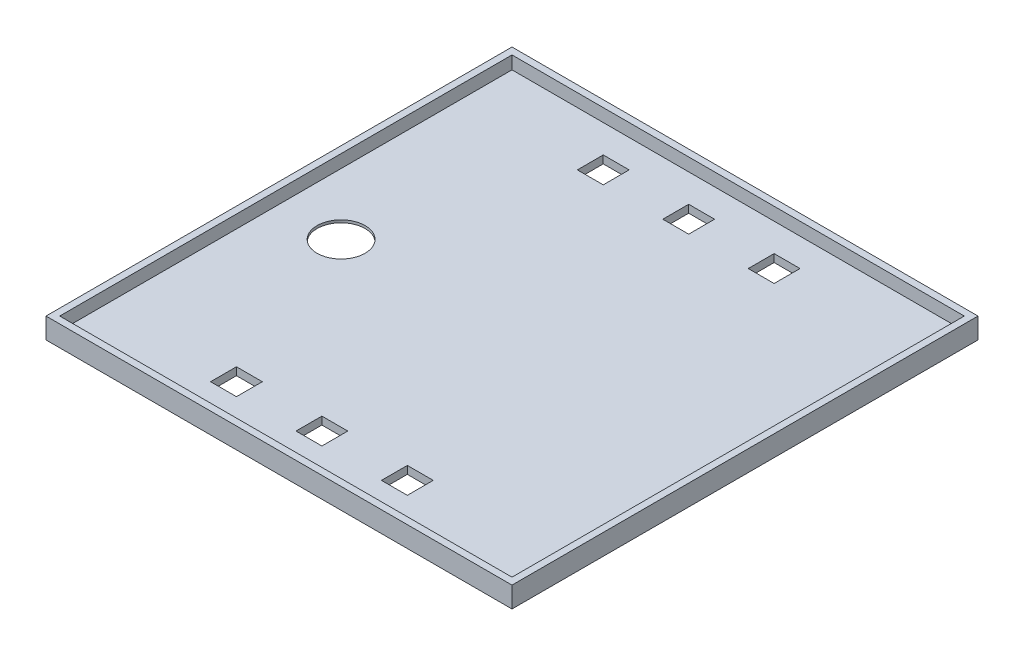
ISO-10303-21;
HEADER;
FILE_DESCRIPTION(('STEP AP214'),'2;1');
FILE_NAME('part.step','',(''),(''),'','','');
FILE_SCHEMA(('AUTOMOTIVE_DESIGN { 1 0 10303 214 1 1 1 1 }'));
ENDSEC;
DATA;
#1=APPLICATION_CONTEXT('core data for automotive mechanical design processes');
#2=APPLICATION_PROTOCOL_DEFINITION('international standard','automotive_design',2000,#1);
#3=PRODUCT_CONTEXT('',#1,'mechanical');
#4=PRODUCT('Part','Part','',(#3));
#5=PRODUCT_RELATED_PRODUCT_CATEGORY('part','',(#4));
#6=PRODUCT_DEFINITION_FORMATION('','',#4);
#7=PRODUCT_DEFINITION_CONTEXT('part definition',#1,'design');
#8=PRODUCT_DEFINITION('design','',#6,#7);
#9=PRODUCT_DEFINITION_SHAPE('','',#8);
#10=(LENGTH_UNIT() NAMED_UNIT(*) SI_UNIT(.MILLI.,.METRE.));
#11=(NAMED_UNIT(*) PLANE_ANGLE_UNIT() SI_UNIT($,.RADIAN.));
#12=(NAMED_UNIT(*) SI_UNIT($,.STERADIAN.) SOLID_ANGLE_UNIT());
#13=UNCERTAINTY_MEASURE_WITH_UNIT(LENGTH_MEASURE(1.E-05),#10,'distance_accuracy_value','');
#14=(GEOMETRIC_REPRESENTATION_CONTEXT(3) GLOBAL_UNCERTAINTY_ASSIGNED_CONTEXT((#13)) GLOBAL_UNIT_ASSIGNED_CONTEXT((#10,
#11,#12)) REPRESENTATION_CONTEXT('',''));
#15=CARTESIAN_POINT('',(0.,0.,0.));
#16=DIRECTION('',(0.,0.,1.));
#17=DIRECTION('',(1.,0.,0.));
#18=AXIS2_PLACEMENT_3D('',#15,#16,#17);
#19=CARTESIAN_POINT('',(45.,4.,45.));
#20=DIRECTION('',(-1.,0.,0.));
#21=DIRECTION('',(0.,0.,1.));
#22=AXIS2_PLACEMENT_3D('',#19,#20,#21);
#23=PLANE('',#22);
#24=DIRECTION('',(0.,0.,-1.));
#25=VECTOR('',#24,1.);
#26=CARTESIAN_POINT('',(45.,0.,45.));
#27=LINE('',#26,#25);
#28=CARTESIAN_POINT('',(45.,0.,45.));
#29=VERTEX_POINT('',#28);
#30=CARTESIAN_POINT('',(45.,0.,-45.));
#31=VERTEX_POINT('',#30);
#32=EDGE_CURVE('E406',#29,#31,#27,.T.);
#33=ORIENTED_EDGE('',*,*,#32,.T.);
#34=DIRECTION('',(0.,-1.,0.));
#35=VECTOR('',#34,1.);
#36=CARTESIAN_POINT('',(45.,4.,-45.));
#37=LINE('',#36,#35);
#38=CARTESIAN_POINT('',(45.,4.,-45.));
#39=VERTEX_POINT('',#38);
#40=EDGE_CURVE('E439',#39,#31,#37,.T.);
#41=ORIENTED_EDGE('',*,*,#40,.F.);
#42=DIRECTION('',(0.,0.,-1.));
#43=VECTOR('',#42,1.);
#44=CARTESIAN_POINT('',(45.,4.,45.));
#45=LINE('',#44,#43);
#46=CARTESIAN_POINT('',(45.,4.,45.));
#47=VERTEX_POINT('',#46);
#48=EDGE_CURVE('E413',#47,#39,#45,.T.);
#49=ORIENTED_EDGE('',*,*,#48,.F.);
#50=DIRECTION('',(0.,-1.,0.));
#51=VECTOR('',#50,1.);
#52=CARTESIAN_POINT('',(45.,4.,45.));
#53=LINE('',#52,#51);
#54=EDGE_CURVE('E423',#47,#29,#53,.T.);
#55=ORIENTED_EDGE('',*,*,#54,.T.);
#56=EDGE_LOOP('',(#33,#41,#49,#55));
#57=FACE_BOUND('',#56,.T.);
#58=ADVANCED_FACE('F41',(#57),#23,.F.);
#59=CARTESIAN_POINT('',(-45.,4.,-45.));
#60=DIRECTION('',(0.,0.,1.));
#61=DIRECTION('',(1.,0.,0.));
#62=AXIS2_PLACEMENT_3D('',#59,#60,#61);
#63=PLANE('',#62);
#64=DIRECTION('',(-1.,0.,0.));
#65=VECTOR('',#64,1.);
#66=CARTESIAN_POINT('',(-45.,0.,-45.));
#67=LINE('',#66,#65);
#68=CARTESIAN_POINT('',(-45.,0.,-45.));
#69=VERTEX_POINT('',#68);
#70=EDGE_CURVE('E426',#31,#69,#67,.T.);
#71=ORIENTED_EDGE('',*,*,#70,.T.);
#72=DIRECTION('',(0.,-1.,0.));
#73=VECTOR('',#72,1.);
#74=CARTESIAN_POINT('',(-45.,4.,-45.));
#75=LINE('',#74,#73);
#76=CARTESIAN_POINT('',(-45.,4.,-45.));
#77=VERTEX_POINT('',#76);
#78=EDGE_CURVE('E436',#77,#69,#75,.T.);
#79=ORIENTED_EDGE('',*,*,#78,.F.);
#80=DIRECTION('',(-1.,0.,0.));
#81=VECTOR('',#80,1.);
#82=CARTESIAN_POINT('',(-45.,4.,-45.));
#83=LINE('',#82,#81);
#84=EDGE_CURVE('E416',#39,#77,#83,.T.);
#85=ORIENTED_EDGE('',*,*,#84,.F.);
#86=ORIENTED_EDGE('',*,*,#40,.T.);
#87=EDGE_LOOP('',(#71,#79,#85,#86));
#88=FACE_BOUND('',#87,.T.);
#89=ADVANCED_FACE('F538',(#88),#63,.F.);
#90=CARTESIAN_POINT('',(-45.,4.,45.));
#91=DIRECTION('',(1.,0.,0.));
#92=DIRECTION('',(0.,0.,-1.));
#93=AXIS2_PLACEMENT_3D('',#90,#91,#92);
#94=PLANE('',#93);
#95=DIRECTION('',(0.,0.,1.));
#96=VECTOR('',#95,1.);
#97=CARTESIAN_POINT('',(-45.,0.,45.));
#98=LINE('',#97,#96);
#99=CARTESIAN_POINT('',(-45.,0.,45.));
#100=VERTEX_POINT('',#99);
#101=EDGE_CURVE('E428',#69,#100,#98,.T.);
#102=ORIENTED_EDGE('',*,*,#101,.T.);
#103=DIRECTION('',(0.,-1.,0.));
#104=VECTOR('',#103,1.);
#105=CARTESIAN_POINT('',(-45.,4.,45.));
#106=LINE('',#105,#104);
#107=CARTESIAN_POINT('',(-45.,4.,45.));
#108=VERTEX_POINT('',#107);
#109=EDGE_CURVE('E433',#108,#100,#106,.T.);
#110=ORIENTED_EDGE('',*,*,#109,.F.);
#111=DIRECTION('',(0.,0.,1.));
#112=VECTOR('',#111,1.);
#113=CARTESIAN_POINT('',(-45.,4.,45.));
#114=LINE('',#113,#112);
#115=EDGE_CURVE('E419',#77,#108,#114,.T.);
#116=ORIENTED_EDGE('',*,*,#115,.F.);
#117=ORIENTED_EDGE('',*,*,#78,.T.);
#118=EDGE_LOOP('',(#102,#110,#116,#117));
#119=FACE_BOUND('',#118,.T.);
#120=ADVANCED_FACE('F543',(#119),#94,.F.);
#121=CARTESIAN_POINT('',(-45.,4.,45.));
#122=DIRECTION('',(0.,0.,-1.));
#123=DIRECTION('',(-1.,0.,0.));
#124=AXIS2_PLACEMENT_3D('',#121,#122,#123);
#125=PLANE('',#124);
#126=DIRECTION('',(1.,0.,0.));
#127=VECTOR('',#126,1.);
#128=CARTESIAN_POINT('',(-45.,0.,45.));
#129=LINE('',#128,#127);
#130=EDGE_CURVE('E417',#100,#29,#129,.T.);
#131=ORIENTED_EDGE('',*,*,#130,.T.);
#132=ORIENTED_EDGE('',*,*,#54,.F.);
#133=DIRECTION('',(1.,0.,0.));
#134=VECTOR('',#133,1.);
#135=CARTESIAN_POINT('',(-45.,4.,45.));
#136=LINE('',#135,#134);
#137=EDGE_CURVE('E421',#108,#47,#136,.T.);
#138=ORIENTED_EDGE('',*,*,#137,.F.);
#139=ORIENTED_EDGE('',*,*,#109,.T.);
#140=EDGE_LOOP('',(#131,#132,#138,#139));
#141=FACE_BOUND('',#140,.T.);
#142=ADVANCED_FACE('F559',(#141),#125,.F.);
#143=CARTESIAN_POINT('',(0.,4.,0.));
#144=DIRECTION('',(0.,-1.,0.));
#145=DIRECTION('',(0.,0.,-1.));
#146=AXIS2_PLACEMENT_3D('',#143,#144,#145);
#147=PLANE('',#146);
#148=DIRECTION('',(-1.,0.,0.));
#149=VECTOR('',#148,1.);
#150=CARTESIAN_POINT('',(-43.675,4.,-43.675));
#151=LINE('',#150,#149);
#152=CARTESIAN_POINT('',(43.675,4.,-43.675));
#153=VERTEX_POINT('',#152);
#154=CARTESIAN_POINT('',(-43.675,4.,-43.675));
#155=VERTEX_POINT('',#154);
#156=EDGE_CURVE('E396',#153,#155,#151,.T.);
#157=ORIENTED_EDGE('',*,*,#156,.F.);
#158=DIRECTION('',(0.,0.,-1.));
#159=VECTOR('',#158,1.);
#160=CARTESIAN_POINT('',(43.675,4.,43.675));
#161=LINE('',#160,#159);
#162=CARTESIAN_POINT('',(43.675,4.,43.675));
#163=VERTEX_POINT('',#162);
#164=EDGE_CURVE('E374',#163,#153,#161,.T.);
#165=ORIENTED_EDGE('',*,*,#164,.F.);
#166=DIRECTION('',(1.,0.,0.));
#167=VECTOR('',#166,1.);
#168=CARTESIAN_POINT('',(-43.675,4.,43.675));
#169=LINE('',#168,#167);
#170=CARTESIAN_POINT('',(-43.675,4.,43.675));
#171=VERTEX_POINT('',#170);
#172=EDGE_CURVE('E385',#171,#163,#169,.T.);
#173=ORIENTED_EDGE('',*,*,#172,.F.);
#174=DIRECTION('',(0.,0.,1.));
#175=VECTOR('',#174,1.);
#176=CARTESIAN_POINT('',(-43.675,4.,43.675));
#177=LINE('',#176,#175);
#178=EDGE_CURVE('E399',#155,#171,#177,.T.);
#179=ORIENTED_EDGE('',*,*,#178,.F.);
#180=EDGE_LOOP('',(#157,#165,#173,#179));
#181=FACE_BOUND('',#180,.T.);
#182=ORIENTED_EDGE('',*,*,#48,.T.);
#183=ORIENTED_EDGE('',*,*,#84,.T.);
#184=ORIENTED_EDGE('',*,*,#115,.T.);
#185=ORIENTED_EDGE('',*,*,#137,.T.);
#186=EDGE_LOOP('',(#182,#183,#184,#185));
#187=FACE_BOUND('',#186,.T.);
#188=ADVANCED_FACE('F555',(#181,#187),#147,.F.);
#189=CARTESIAN_POINT('',(0.,0.,0.));
#190=DIRECTION('',(0.,-1.,0.));
#191=DIRECTION('',(0.,0.,-1.));
#192=AXIS2_PLACEMENT_3D('',#189,#190,#191);
#193=PLANE('',#192);
#194=CARTESIAN_POINT('',(-31.8184158682217,0.,1.19003743829275));
#195=DIRECTION('',(0.,-1.,0.));
#196=DIRECTION('',(0.,0.,-1.));
#197=AXIS2_PLACEMENT_3D('',#194,#195,#196);
#198=CIRCLE('',#197,6.5);
#199=CARTESIAN_POINT('',(-31.8184158682217,0.,-5.30996256170725));
#200=VERTEX_POINT('',#199);
#201=EDGE_CURVE('E982',#200,#200,#198,.T.);
#202=ORIENTED_EDGE('',*,*,#201,.F.);
#203=EDGE_LOOP('',(#202));
#204=FACE_BOUND('',#203,.T.);
#205=DIRECTION('',(0.,0.,1.));
#206=VECTOR('',#205,1.);
#207=CARTESIAN_POINT('',(0.866184452047224,0.,-38.2574744765441));
#208=LINE('',#207,#206);
#209=CARTESIAN_POINT('',(0.866184452047224,0.,-38.2574744765441));
#210=VERTEX_POINT('',#209);
#211=CARTESIAN_POINT('',(0.866184452047224,0.,-33.2574744765441));
#212=VERTEX_POINT('',#211);
#213=EDGE_CURVE('E56',#210,#212,#208,.T.);
#214=ORIENTED_EDGE('',*,*,#213,.F.);
#215=DIRECTION('',(1.,0.,0.));
#216=VECTOR('',#215,1.);
#217=CARTESIAN_POINT('',(0.866184452047224,0.,-38.2574744765441));
#218=LINE('',#217,#216);
#219=CARTESIAN_POINT('',(-4.13381554795278,0.,-38.2574744765441));
#220=VERTEX_POINT('',#219);
#221=EDGE_CURVE('E289',#220,#210,#218,.T.);
#222=ORIENTED_EDGE('',*,*,#221,.F.);
#223=DIRECTION('',(0.,0.,-1.));
#224=VECTOR('',#223,1.);
#225=CARTESIAN_POINT('',(-4.13381554795278,0.,-38.2574744765441));
#226=LINE('',#225,#224);
#227=CARTESIAN_POINT('',(-4.13381554795278,0.,-33.2574744765441));
#228=VERTEX_POINT('',#227);
#229=EDGE_CURVE('E298',#228,#220,#226,.T.);
#230=ORIENTED_EDGE('',*,*,#229,.F.);
#231=DIRECTION('',(-1.,0.,0.));
#232=VECTOR('',#231,1.);
#233=CARTESIAN_POINT('',(0.866184452047224,0.,-33.2574744765441));
#234=LINE('',#233,#232);
#235=EDGE_CURVE('E301',#212,#228,#234,.T.);
#236=ORIENTED_EDGE('',*,*,#235,.F.);
#237=EDGE_LOOP('',(#214,#222,#230,#236));
#238=FACE_BOUND('',#237,.T.);
#239=DIRECTION('',(0.,0.,1.));
#240=VECTOR('',#239,1.);
#241=CARTESIAN_POINT('',(-15.6344538149361,0.,-38.2574744765441));
#242=LINE('',#241,#240);
#243=CARTESIAN_POINT('',(-15.6344538149361,0.,-38.2574744765441));
#244=VERTEX_POINT('',#243);
#245=CARTESIAN_POINT('',(-15.6344538149361,0.,-33.2574744765441));
#246=VERTEX_POINT('',#245);
#247=EDGE_CURVE('E64',#244,#246,#242,.T.);
#248=ORIENTED_EDGE('',*,*,#247,.F.);
#249=DIRECTION('',(1.,0.,0.));
#250=VECTOR('',#249,1.);
#251=CARTESIAN_POINT('',(-15.6344538149361,0.,-38.2574744765441));
#252=LINE('',#251,#250);
#253=CARTESIAN_POINT('',(-20.6344538149361,0.,-38.2574744765441));
#254=VERTEX_POINT('',#253);
#255=EDGE_CURVE('E308',#254,#244,#252,.T.);
#256=ORIENTED_EDGE('',*,*,#255,.F.);
#257=DIRECTION('',(0.,0.,-1.));
#258=VECTOR('',#257,1.);
#259=CARTESIAN_POINT('',(-20.6344538149361,0.,-38.2574744765441));
#260=LINE('',#259,#258);
#261=CARTESIAN_POINT('',(-20.6344538149361,0.,-33.2574744765441));
#262=VERTEX_POINT('',#261);
#263=EDGE_CURVE('E318',#262,#254,#260,.T.);
#264=ORIENTED_EDGE('',*,*,#263,.F.);
#265=DIRECTION('',(-1.,0.,0.));
#266=VECTOR('',#265,1.);
#267=CARTESIAN_POINT('',(-15.6344538149361,0.,-33.2574744765441));
#268=LINE('',#267,#266);
#269=EDGE_CURVE('E321',#246,#262,#268,.T.);
#270=ORIENTED_EDGE('',*,*,#269,.F.);
#271=EDGE_LOOP('',(#248,#256,#264,#270));
#272=FACE_BOUND('',#271,.T.);
#273=DIRECTION('',(0.,0.,1.));
#274=VECTOR('',#273,1.);
#275=CARTESIAN_POINT('',(17.3766614796135,0.,32.5926004424783));
#276=LINE('',#275,#274);
#277=CARTESIAN_POINT('',(17.3766614796135,0.,32.5926004424783));
#278=VERTEX_POINT('',#277);
#279=CARTESIAN_POINT('',(17.3766614796135,0.,37.5926004424783));
#280=VERTEX_POINT('',#279);
#281=EDGE_CURVE('E315',#278,#280,#276,.T.);
#282=ORIENTED_EDGE('',*,*,#281,.F.);
#283=DIRECTION('',(1.,0.,0.));
#284=VECTOR('',#283,1.);
#285=CARTESIAN_POINT('',(17.3766614796135,0.,32.5926004424783));
#286=LINE('',#285,#284);
#287=CARTESIAN_POINT('',(12.3766614796135,0.,32.5926004424783));
#288=VERTEX_POINT('',#287);
#289=EDGE_CURVE('E328',#288,#278,#286,.T.);
#290=ORIENTED_EDGE('',*,*,#289,.F.);
#291=DIRECTION('',(0.,0.,-1.));
#292=VECTOR('',#291,1.);
#293=CARTESIAN_POINT('',(12.3766614796135,0.,32.5926004424783));
#294=LINE('',#293,#292);
#295=CARTESIAN_POINT('',(12.3766614796135,0.,37.5926004424783));
#296=VERTEX_POINT('',#295);
#297=EDGE_CURVE('E338',#296,#288,#294,.T.);
#298=ORIENTED_EDGE('',*,*,#297,.F.);
#299=DIRECTION('',(-1.,0.,0.));
#300=VECTOR('',#299,1.);
#301=CARTESIAN_POINT('',(17.3766614796135,0.,37.5926004424783));
#302=LINE('',#301,#300);
#303=EDGE_CURVE('E341',#280,#296,#302,.T.);
#304=ORIENTED_EDGE('',*,*,#303,.F.);
#305=EDGE_LOOP('',(#282,#290,#298,#304));
#306=FACE_BOUND('',#305,.T.);
#307=DIRECTION('',(0.,0.,1.));
#308=VECTOR('',#307,1.);
#309=CARTESIAN_POINT('',(0.876023212630174,0.,32.5926004424783));
#310=LINE('',#309,#308);
#311=CARTESIAN_POINT('',(0.876023212630174,0.,32.5926004424783));
#312=VERTEX_POINT('',#311);
#313=CARTESIAN_POINT('',(0.876023212630174,0.,37.5926004424783));
#314=VERTEX_POINT('',#313);
#315=EDGE_CURVE('E335',#312,#314,#310,.T.);
#316=ORIENTED_EDGE('',*,*,#315,.F.);
#317=DIRECTION('',(1.,0.,0.));
#318=VECTOR('',#317,1.);
#319=CARTESIAN_POINT('',(0.876023212630174,0.,32.5926004424783));
#320=LINE('',#319,#318);
#321=CARTESIAN_POINT('',(-4.12397678736983,0.,32.5926004424783));
#322=VERTEX_POINT('',#321);
#323=EDGE_CURVE('E348',#322,#312,#320,.T.);
#324=ORIENTED_EDGE('',*,*,#323,.F.);
#325=DIRECTION('',(0.,0.,-1.));
#326=VECTOR('',#325,1.);
#327=CARTESIAN_POINT('',(-4.12397678736983,0.,32.5926004424783));
#328=LINE('',#327,#326);
#329=CARTESIAN_POINT('',(-4.12397678736983,0.,37.5926004424783));
#330=VERTEX_POINT('',#329);
#331=EDGE_CURVE('E354',#330,#322,#328,.T.);
#332=ORIENTED_EDGE('',*,*,#331,.F.);
#333=DIRECTION('',(-1.,0.,0.));
#334=VECTOR('',#333,1.);
#335=CARTESIAN_POINT('',(0.876023212630174,0.,37.5926004424783));
#336=LINE('',#335,#334);
#337=EDGE_CURVE('E357',#314,#330,#336,.T.);
#338=ORIENTED_EDGE('',*,*,#337,.F.);
#339=EDGE_LOOP('',(#316,#324,#332,#338));
#340=FACE_BOUND('',#339,.T.);
#341=DIRECTION('',(0.,0.,1.));
#342=VECTOR('',#341,1.);
#343=CARTESIAN_POINT('',(-15.6246150543532,0.,32.5926004424783));
#344=LINE('',#343,#342);
#345=CARTESIAN_POINT('',(-15.6246150543532,0.,32.5926004424783));
#346=VERTEX_POINT('',#345);
#347=CARTESIAN_POINT('',(-15.6246150543532,0.,37.5926004424783));
#348=VERTEX_POINT('',#347);
#349=EDGE_CURVE('E256',#346,#348,#344,.T.);
#350=ORIENTED_EDGE('',*,*,#349,.F.);
#351=DIRECTION('',(1.,0.,0.));
#352=VECTOR('',#351,1.);
#353=CARTESIAN_POINT('',(-15.6246150543532,0.,32.5926004424783));
#354=LINE('',#353,#352);
#355=CARTESIAN_POINT('',(-20.6246150543532,0.,32.5926004424783));
#356=VERTEX_POINT('',#355);
#357=EDGE_CURVE('E266',#356,#346,#354,.T.);
#358=ORIENTED_EDGE('',*,*,#357,.F.);
#359=DIRECTION('',(0.,0.,-1.));
#360=VECTOR('',#359,1.);
#361=CARTESIAN_POINT('',(-20.6246150543532,0.,32.5926004424783));
#362=LINE('',#361,#360);
#363=CARTESIAN_POINT('',(-20.6246150543532,0.,37.5926004424783));
#364=VERTEX_POINT('',#363);
#365=EDGE_CURVE('E272',#364,#356,#362,.T.);
#366=ORIENTED_EDGE('',*,*,#365,.F.);
#367=DIRECTION('',(-1.,0.,0.));
#368=VECTOR('',#367,1.);
#369=CARTESIAN_POINT('',(-15.6246150543532,0.,37.5926004424783));
#370=LINE('',#369,#368);
#371=EDGE_CURVE('E279',#348,#364,#370,.T.);
#372=ORIENTED_EDGE('',*,*,#371,.F.);
#373=EDGE_LOOP('',(#350,#358,#366,#372));
#374=FACE_BOUND('',#373,.T.);
#375=DIRECTION('',(0.,0.,1.));
#376=VECTOR('',#375,1.);
#377=CARTESIAN_POINT('',(17.3668227190306,0.,-38.2574744765441));
#378=LINE('',#377,#376);
#379=CARTESIAN_POINT('',(17.3668227190306,0.,-38.2574744765441));
#380=VERTEX_POINT('',#379);
#381=CARTESIAN_POINT('',(17.3668227190306,0.,-33.2574744765441));
#382=VERTEX_POINT('',#381);
#383=EDGE_CURVE('E305',#380,#382,#378,.T.);
#384=ORIENTED_EDGE('',*,*,#383,.F.);
#385=DIRECTION('',(1.,0.,0.));
#386=VECTOR('',#385,1.);
#387=CARTESIAN_POINT('',(17.3668227190306,0.,-38.2574744765441));
#388=LINE('',#387,#386);
#389=CARTESIAN_POINT('',(12.3668227190306,0.,-38.2574744765441));
#390=VERTEX_POINT('',#389);
#391=EDGE_CURVE('E368',#390,#380,#388,.T.);
#392=ORIENTED_EDGE('',*,*,#391,.F.);
#393=DIRECTION('',(0.,0.,-1.));
#394=VECTOR('',#393,1.);
#395=CARTESIAN_POINT('',(12.3668227190306,0.,-38.2574744765441));
#396=LINE('',#395,#394);
#397=CARTESIAN_POINT('',(12.3668227190306,0.,-33.2574744765441));
#398=VERTEX_POINT('',#397);
#399=EDGE_CURVE('E365',#398,#390,#396,.T.);
#400=ORIENTED_EDGE('',*,*,#399,.F.);
#401=DIRECTION('',(-1.,0.,0.));
#402=VECTOR('',#401,1.);
#403=CARTESIAN_POINT('',(17.3668227190306,0.,-33.2574744765441));
#404=LINE('',#403,#402);
#405=EDGE_CURVE('E362',#382,#398,#404,.T.);
#406=ORIENTED_EDGE('',*,*,#405,.F.);
#407=EDGE_LOOP('',(#384,#392,#400,#406));
#408=FACE_BOUND('',#407,.T.);
#409=ORIENTED_EDGE('',*,*,#32,.F.);
#410=ORIENTED_EDGE('',*,*,#130,.F.);
#411=ORIENTED_EDGE('',*,*,#101,.F.);
#412=ORIENTED_EDGE('',*,*,#70,.F.);
#413=EDGE_LOOP('',(#409,#410,#411,#412));
#414=FACE_BOUND('',#413,.T.);
#415=ADVANCED_FACE('F276',(#204,#238,#272,#306,#340,#374,#408,#414),#193,.T.);
#416=CARTESIAN_POINT('',(43.675,1.5,43.675));
#417=DIRECTION('',(1.,0.,0.));
#418=DIRECTION('',(0.,0.,-1.));
#419=AXIS2_PLACEMENT_3D('',#416,#417,#418);
#420=PLANE('',#419);
#421=ORIENTED_EDGE('',*,*,#164,.T.);
#422=DIRECTION('',(0.,1.,0.));
#423=VECTOR('',#422,1.);
#424=CARTESIAN_POINT('',(43.675,1.5,-43.675));
#425=LINE('',#424,#423);
#426=CARTESIAN_POINT('',(43.675,1.5,-43.675));
#427=VERTEX_POINT('',#426);
#428=EDGE_CURVE('E394',#427,#153,#425,.T.);
#429=ORIENTED_EDGE('',*,*,#428,.F.);
#430=DIRECTION('',(0.,0.,-1.));
#431=VECTOR('',#430,1.);
#432=CARTESIAN_POINT('',(43.675,1.5,43.675));
#433=LINE('',#432,#431);
#434=CARTESIAN_POINT('',(43.675,1.5,43.675));
#435=VERTEX_POINT('',#434);
#436=EDGE_CURVE('E381',#435,#427,#433,.T.);
#437=ORIENTED_EDGE('',*,*,#436,.F.);
#438=DIRECTION('',(0.,1.,0.));
#439=VECTOR('',#438,1.);
#440=CARTESIAN_POINT('',(43.675,1.5,43.675));
#441=LINE('',#440,#439);
#442=EDGE_CURVE('E404',#435,#163,#441,.T.);
#443=ORIENTED_EDGE('',*,*,#442,.T.);
#444=EDGE_LOOP('',(#421,#429,#437,#443));
#445=FACE_BOUND('',#444,.T.);
#446=ADVANCED_FACE('F570',(#445),#420,.F.);
#447=CARTESIAN_POINT('',(-43.675,1.5,43.675));
#448=DIRECTION('',(0.,0.,1.));
#449=DIRECTION('',(1.,0.,0.));
#450=AXIS2_PLACEMENT_3D('',#447,#448,#449);
#451=PLANE('',#450);
#452=ORIENTED_EDGE('',*,*,#172,.T.);
#453=ORIENTED_EDGE('',*,*,#442,.F.);
#454=DIRECTION('',(1.,0.,0.));
#455=VECTOR('',#454,1.);
#456=CARTESIAN_POINT('',(-43.675,1.5,43.675));
#457=LINE('',#456,#455);
#458=CARTESIAN_POINT('',(-43.675,1.5,43.675));
#459=VERTEX_POINT('',#458);
#460=EDGE_CURVE('E391',#459,#435,#457,.T.);
#461=ORIENTED_EDGE('',*,*,#460,.F.);
#462=DIRECTION('',(0.,1.,0.));
#463=VECTOR('',#462,1.);
#464=CARTESIAN_POINT('',(-43.675,1.5,43.675));
#465=LINE('',#464,#463);
#466=EDGE_CURVE('E407',#459,#171,#465,.T.);
#467=ORIENTED_EDGE('',*,*,#466,.T.);
#468=EDGE_LOOP('',(#452,#453,#461,#467));
#469=FACE_BOUND('',#468,.T.);
#470=ADVANCED_FACE('F577',(#469),#451,.F.);
#471=CARTESIAN_POINT('',(-43.675,1.5,43.675));
#472=DIRECTION('',(-1.,0.,0.));
#473=DIRECTION('',(0.,0.,1.));
#474=AXIS2_PLACEMENT_3D('',#471,#472,#473);
#475=PLANE('',#474);
#476=ORIENTED_EDGE('',*,*,#178,.T.);
#477=ORIENTED_EDGE('',*,*,#466,.F.);
#478=DIRECTION('',(0.,0.,1.));
#479=VECTOR('',#478,1.);
#480=CARTESIAN_POINT('',(-43.675,1.5,43.675));
#481=LINE('',#480,#479);
#482=CARTESIAN_POINT('',(-43.675,1.5,-43.675));
#483=VERTEX_POINT('',#482);
#484=EDGE_CURVE('E388',#483,#459,#481,.T.);
#485=ORIENTED_EDGE('',*,*,#484,.F.);
#486=DIRECTION('',(0.,1.,0.));
#487=VECTOR('',#486,1.);
#488=CARTESIAN_POINT('',(-43.675,1.5,-43.675));
#489=LINE('',#488,#487);
#490=EDGE_CURVE('E409',#483,#155,#489,.T.);
#491=ORIENTED_EDGE('',*,*,#490,.T.);
#492=EDGE_LOOP('',(#476,#477,#485,#491));
#493=FACE_BOUND('',#492,.T.);
#494=ADVANCED_FACE('F582',(#493),#475,.F.);
#495=CARTESIAN_POINT('',(-43.675,1.5,-43.675));
#496=DIRECTION('',(0.,0.,-1.));
#497=DIRECTION('',(-1.,0.,0.));
#498=AXIS2_PLACEMENT_3D('',#495,#496,#497);
#499=PLANE('',#498);
#500=ORIENTED_EDGE('',*,*,#156,.T.);
#501=ORIENTED_EDGE('',*,*,#490,.F.);
#502=DIRECTION('',(-1.,0.,0.));
#503=VECTOR('',#502,1.);
#504=CARTESIAN_POINT('',(-43.675,1.5,-43.675));
#505=LINE('',#504,#503);
#506=EDGE_CURVE('E384',#427,#483,#505,.T.);
#507=ORIENTED_EDGE('',*,*,#506,.F.);
#508=ORIENTED_EDGE('',*,*,#428,.T.);
#509=EDGE_LOOP('',(#500,#501,#507,#508));
#510=FACE_BOUND('',#509,.T.);
#511=ADVANCED_FACE('F579',(#510),#499,.F.);
#512=CARTESIAN_POINT('',(0.,1.5,0.));
#513=DIRECTION('',(0.,-1.,0.));
#514=DIRECTION('',(0.,0.,-1.));
#515=AXIS2_PLACEMENT_3D('',#512,#513,#514);
#516=PLANE('',#515);
#517=CARTESIAN_POINT('',(-31.8184158682217,1.5,1.19003743829275));
#518=DIRECTION('',(0.,-1.,0.));
#519=DIRECTION('',(0.,0.,-1.));
#520=AXIS2_PLACEMENT_3D('',#517,#518,#519);
#521=CIRCLE('',#520,4.63790546829669);
#522=CARTESIAN_POINT('',(-31.8184158682217,1.5,-3.44786803000395));
#523=VERTEX_POINT('',#522);
#524=EDGE_CURVE('E44',#523,#523,#521,.T.);
#525=ORIENTED_EDGE('',*,*,#524,.T.);
#526=EDGE_LOOP('',(#525));
#527=FACE_BOUND('',#526,.T.);
#528=DIRECTION('',(1.,0.,0.));
#529=VECTOR('',#528,1.);
#530=CARTESIAN_POINT('',(0.,1.5,-38.2574744765441));
#531=LINE('',#530,#529);
#532=CARTESIAN_POINT('',(-4.13381554795278,1.5,-38.2574744765441));
#533=VERTEX_POINT('',#532);
#534=CARTESIAN_POINT('',(0.866184452047224,1.5,-38.2574744765441));
#535=VERTEX_POINT('',#534);
#536=EDGE_CURVE('E49',#533,#535,#531,.T.);
#537=ORIENTED_EDGE('',*,*,#536,.T.);
#538=DIRECTION('',(0.,0.,1.));
#539=VECTOR('',#538,1.);
#540=CARTESIAN_POINT('',(0.866184452047224,1.5,0.));
#541=LINE('',#540,#539);
#542=CARTESIAN_POINT('',(0.866184452047224,1.5,-33.2574744765441));
#543=VERTEX_POINT('',#542);
#544=EDGE_CURVE('E11',#535,#543,#541,.T.);
#545=ORIENTED_EDGE('',*,*,#544,.T.);
#546=DIRECTION('',(-1.,0.,0.));
#547=VECTOR('',#546,1.);
#548=CARTESIAN_POINT('',(0.,1.5,-33.2574744765441));
#549=LINE('',#548,#547);
#550=CARTESIAN_POINT('',(-4.13381554795278,1.5,-33.2574744765441));
#551=VERTEX_POINT('',#550);
#552=EDGE_CURVE('E499',#543,#551,#549,.T.);
#553=ORIENTED_EDGE('',*,*,#552,.T.);
#554=DIRECTION('',(0.,0.,-1.));
#555=VECTOR('',#554,1.);
#556=CARTESIAN_POINT('',(-4.13381554795278,1.5,0.));
#557=LINE('',#556,#555);
#558=EDGE_CURVE('E502',#551,#533,#557,.T.);
#559=ORIENTED_EDGE('',*,*,#558,.T.);
#560=EDGE_LOOP('',(#537,#545,#553,#559));
#561=FACE_BOUND('',#560,.T.);
#562=DIRECTION('',(1.,0.,0.));
#563=VECTOR('',#562,1.);
#564=CARTESIAN_POINT('',(0.,1.5,-38.2574744765441));
#565=LINE('',#564,#563);
#566=CARTESIAN_POINT('',(-20.6344538149361,1.5,-38.2574744765441));
#567=VERTEX_POINT('',#566);
#568=CARTESIAN_POINT('',(-15.6344538149361,1.5,-38.2574744765441));
#569=VERTEX_POINT('',#568);
#570=EDGE_CURVE('E493',#567,#569,#565,.T.);
#571=ORIENTED_EDGE('',*,*,#570,.T.);
#572=DIRECTION('',(0.,0.,1.));
#573=VECTOR('',#572,1.);
#574=CARTESIAN_POINT('',(-15.6344538149361,1.5,0.));
#575=LINE('',#574,#573);
#576=CARTESIAN_POINT('',(-15.6344538149361,1.5,-33.2574744765441));
#577=VERTEX_POINT('',#576);
#578=EDGE_CURVE('E496',#569,#577,#575,.T.);
#579=ORIENTED_EDGE('',*,*,#578,.T.);
#580=DIRECTION('',(-1.,0.,0.));
#581=VECTOR('',#580,1.);
#582=CARTESIAN_POINT('',(0.,1.5,-33.2574744765441));
#583=LINE('',#582,#581);
#584=CARTESIAN_POINT('',(-20.6344538149361,1.5,-33.2574744765441));
#585=VERTEX_POINT('',#584);
#586=EDGE_CURVE('E487',#577,#585,#583,.T.);
#587=ORIENTED_EDGE('',*,*,#586,.T.);
#588=DIRECTION('',(0.,0.,-1.));
#589=VECTOR('',#588,1.);
#590=CARTESIAN_POINT('',(-20.6344538149361,1.5,0.));
#591=LINE('',#590,#589);
#592=EDGE_CURVE('E490',#585,#567,#591,.T.);
#593=ORIENTED_EDGE('',*,*,#592,.T.);
#594=EDGE_LOOP('',(#571,#579,#587,#593));
#595=FACE_BOUND('',#594,.T.);
#596=DIRECTION('',(1.,0.,0.));
#597=VECTOR('',#596,1.);
#598=CARTESIAN_POINT('',(0.,1.5,32.5926004424783));
#599=LINE('',#598,#597);
#600=CARTESIAN_POINT('',(12.3766614796135,1.5,32.5926004424783));
#601=VERTEX_POINT('',#600);
#602=CARTESIAN_POINT('',(17.3766614796135,1.5,32.5926004424783));
#603=VERTEX_POINT('',#602);
#604=EDGE_CURVE('E481',#601,#603,#599,.T.);
#605=ORIENTED_EDGE('',*,*,#604,.T.);
#606=DIRECTION('',(0.,0.,1.));
#607=VECTOR('',#606,1.);
#608=CARTESIAN_POINT('',(17.3766614796135,1.5,0.));
#609=LINE('',#608,#607);
#610=CARTESIAN_POINT('',(17.3766614796135,1.5,37.5926004424783));
#611=VERTEX_POINT('',#610);
#612=EDGE_CURVE('E484',#603,#611,#609,.T.);
#613=ORIENTED_EDGE('',*,*,#612,.T.);
#614=DIRECTION('',(-1.,0.,0.));
#615=VECTOR('',#614,1.);
#616=CARTESIAN_POINT('',(0.,1.5,37.5926004424783));
#617=LINE('',#616,#615);
#618=CARTESIAN_POINT('',(12.3766614796135,1.5,37.5926004424783));
#619=VERTEX_POINT('',#618);
#620=EDGE_CURVE('E475',#611,#619,#617,.T.);
#621=ORIENTED_EDGE('',*,*,#620,.T.);
#622=DIRECTION('',(0.,0.,-1.));
#623=VECTOR('',#622,1.);
#624=CARTESIAN_POINT('',(12.3766614796135,1.5,0.));
#625=LINE('',#624,#623);
#626=EDGE_CURVE('E478',#619,#601,#625,.T.);
#627=ORIENTED_EDGE('',*,*,#626,.T.);
#628=EDGE_LOOP('',(#605,#613,#621,#627));
#629=FACE_BOUND('',#628,.T.);
#630=DIRECTION('',(1.,0.,0.));
#631=VECTOR('',#630,1.);
#632=CARTESIAN_POINT('',(0.,1.5,32.5926004424783));
#633=LINE('',#632,#631);
#634=CARTESIAN_POINT('',(-4.12397678736983,1.5,32.5926004424783));
#635=VERTEX_POINT('',#634);
#636=CARTESIAN_POINT('',(0.876023212630174,1.5,32.5926004424783));
#637=VERTEX_POINT('',#636);
#638=EDGE_CURVE('E469',#635,#637,#633,.T.);
#639=ORIENTED_EDGE('',*,*,#638,.T.);
#640=DIRECTION('',(0.,0.,1.));
#641=VECTOR('',#640,1.);
#642=CARTESIAN_POINT('',(0.876023212630174,1.5,0.));
#643=LINE('',#642,#641);
#644=CARTESIAN_POINT('',(0.876023212630174,1.5,37.5926004424783));
#645=VERTEX_POINT('',#644);
#646=EDGE_CURVE('E472',#637,#645,#643,.T.);
#647=ORIENTED_EDGE('',*,*,#646,.T.);
#648=DIRECTION('',(-1.,0.,0.));
#649=VECTOR('',#648,1.);
#650=CARTESIAN_POINT('',(0.,1.5,37.5926004424783));
#651=LINE('',#650,#649);
#652=CARTESIAN_POINT('',(-4.12397678736983,1.5,37.5926004424783));
#653=VERTEX_POINT('',#652);
#654=EDGE_CURVE('E463',#645,#653,#651,.T.);
#655=ORIENTED_EDGE('',*,*,#654,.T.);
#656=DIRECTION('',(0.,0.,-1.));
#657=VECTOR('',#656,1.);
#658=CARTESIAN_POINT('',(-4.12397678736983,1.5,0.));
#659=LINE('',#658,#657);
#660=EDGE_CURVE('E466',#653,#635,#659,.T.);
#661=ORIENTED_EDGE('',*,*,#660,.T.);
#662=EDGE_LOOP('',(#639,#647,#655,#661));
#663=FACE_BOUND('',#662,.T.);
#664=DIRECTION('',(1.,0.,0.));
#665=VECTOR('',#664,1.);
#666=CARTESIAN_POINT('',(0.,1.5,32.5926004424783));
#667=LINE('',#666,#665);
#668=CARTESIAN_POINT('',(-20.6246150543532,1.5,32.5926004424783));
#669=VERTEX_POINT('',#668);
#670=CARTESIAN_POINT('',(-15.6246150543532,1.5,32.5926004424783));
#671=VERTEX_POINT('',#670);
#672=EDGE_CURVE('E460',#669,#671,#667,.T.);
#673=ORIENTED_EDGE('',*,*,#672,.T.);
#674=DIRECTION('',(0.,0.,1.));
#675=VECTOR('',#674,1.);
#676=CARTESIAN_POINT('',(-15.6246150543532,1.5,0.));
#677=LINE('',#676,#675);
#678=CARTESIAN_POINT('',(-15.6246150543532,1.5,37.5926004424783));
#679=VERTEX_POINT('',#678);
#680=EDGE_CURVE('E259',#671,#679,#677,.T.);
#681=ORIENTED_EDGE('',*,*,#680,.T.);
#682=DIRECTION('',(-1.,0.,0.));
#683=VECTOR('',#682,1.);
#684=CARTESIAN_POINT('',(0.,1.5,37.5926004424783));
#685=LINE('',#684,#683);
#686=CARTESIAN_POINT('',(-20.6246150543532,1.5,37.5926004424783));
#687=VERTEX_POINT('',#686);
#688=EDGE_CURVE('E454',#679,#687,#685,.T.);
#689=ORIENTED_EDGE('',*,*,#688,.T.);
#690=DIRECTION('',(0.,0.,-1.));
#691=VECTOR('',#690,1.);
#692=CARTESIAN_POINT('',(-20.6246150543532,1.5,0.));
#693=LINE('',#692,#691);
#694=EDGE_CURVE('E457',#687,#669,#693,.T.);
#695=ORIENTED_EDGE('',*,*,#694,.T.);
#696=EDGE_LOOP('',(#673,#681,#689,#695));
#697=FACE_BOUND('',#696,.T.);
#698=DIRECTION('',(1.,0.,0.));
#699=VECTOR('',#698,1.);
#700=CARTESIAN_POINT('',(0.,1.5,-38.2574744765441));
#701=LINE('',#700,#699);
#702=CARTESIAN_POINT('',(12.3668227190306,1.5,-38.2574744765441));
#703=VERTEX_POINT('',#702);
#704=CARTESIAN_POINT('',(17.3668227190306,1.5,-38.2574744765441));
#705=VERTEX_POINT('',#704);
#706=EDGE_CURVE('E448',#703,#705,#701,.T.);
#707=ORIENTED_EDGE('',*,*,#706,.T.);
#708=DIRECTION('',(0.,0.,1.));
#709=VECTOR('',#708,1.);
#710=CARTESIAN_POINT('',(17.3668227190306,1.5,0.));
#711=LINE('',#710,#709);
#712=CARTESIAN_POINT('',(17.3668227190306,1.5,-33.2574744765441));
#713=VERTEX_POINT('',#712);
#714=EDGE_CURVE('E451',#705,#713,#711,.T.);
#715=ORIENTED_EDGE('',*,*,#714,.T.);
#716=DIRECTION('',(-1.,0.,0.));
#717=VECTOR('',#716,1.);
#718=CARTESIAN_POINT('',(0.,1.5,-33.2574744765441));
#719=LINE('',#718,#717);
#720=CARTESIAN_POINT('',(12.3668227190306,1.5,-33.2574744765441));
#721=VERTEX_POINT('',#720);
#722=EDGE_CURVE('E442',#713,#721,#719,.T.);
#723=ORIENTED_EDGE('',*,*,#722,.T.);
#724=DIRECTION('',(0.,0.,-1.));
#725=VECTOR('',#724,1.);
#726=CARTESIAN_POINT('',(12.3668227190306,1.5,0.));
#727=LINE('',#726,#725);
#728=EDGE_CURVE('E445',#721,#703,#727,.T.);
#729=ORIENTED_EDGE('',*,*,#728,.T.);
#730=EDGE_LOOP('',(#707,#715,#723,#729));
#731=FACE_BOUND('',#730,.T.);
#732=ORIENTED_EDGE('',*,*,#436,.T.);
#733=ORIENTED_EDGE('',*,*,#506,.T.);
#734=ORIENTED_EDGE('',*,*,#484,.T.);
#735=ORIENTED_EDGE('',*,*,#460,.T.);
#736=EDGE_LOOP('',(#732,#733,#734,#735));
#737=FACE_BOUND('',#736,.T.);
#738=ADVANCED_FACE('F507',(#527,#561,#595,#629,#663,#697,#731,#737),#516,.F.);
#739=CARTESIAN_POINT('',(17.3668227190306,3.,-38.2574744765441));
#740=DIRECTION('',(1.,0.,0.));
#741=DIRECTION('',(0.,0.,-1.));
#742=AXIS2_PLACEMENT_3D('',#739,#740,#741);
#743=PLANE('',#742);
#744=DIRECTION('',(0.,-1.,0.));
#745=VECTOR('',#744,1.);
#746=CARTESIAN_POINT('',(17.3668227190306,3.,-38.2574744765441));
#747=LINE('',#746,#745);
#748=EDGE_CURVE('E372',#705,#380,#747,.T.);
#749=ORIENTED_EDGE('',*,*,#748,.T.);
#750=ORIENTED_EDGE('',*,*,#383,.T.);
#751=DIRECTION('',(0.,-1.,0.));
#752=VECTOR('',#751,1.);
#753=CARTESIAN_POINT('',(17.3668227190306,3.,-33.2574744765441));
#754=LINE('',#753,#752);
#755=EDGE_CURVE('E371',#713,#382,#754,.T.);
#756=ORIENTED_EDGE('',*,*,#755,.F.);
#757=ORIENTED_EDGE('',*,*,#714,.F.);
#758=EDGE_LOOP('',(#749,#750,#756,#757));
#759=FACE_BOUND('',#758,.T.);
#760=ADVANCED_FACE('F592',(#759),#743,.F.);
#761=CARTESIAN_POINT('',(17.3668227190306,3.,-38.2574744765441));
#762=DIRECTION('',(0.,0.,-1.));
#763=DIRECTION('',(-1.,0.,0.));
#764=AXIS2_PLACEMENT_3D('',#761,#762,#763);
#765=PLANE('',#764);
#766=DIRECTION('',(0.,-1.,0.));
#767=VECTOR('',#766,1.);
#768=CARTESIAN_POINT('',(12.3668227190306,3.,-38.2574744765441));
#769=LINE('',#768,#767);
#770=EDGE_CURVE('E375',#703,#390,#769,.T.);
#771=ORIENTED_EDGE('',*,*,#770,.T.);
#772=ORIENTED_EDGE('',*,*,#391,.T.);
#773=ORIENTED_EDGE('',*,*,#748,.F.);
#774=ORIENTED_EDGE('',*,*,#706,.F.);
#775=EDGE_LOOP('',(#771,#772,#773,#774));
#776=FACE_BOUND('',#775,.T.);
#777=ADVANCED_FACE('F596',(#776),#765,.F.);
#778=CARTESIAN_POINT('',(12.3668227190306,3.,-38.2574744765441));
#779=DIRECTION('',(-1.,0.,0.));
#780=DIRECTION('',(0.,0.,1.));
#781=AXIS2_PLACEMENT_3D('',#778,#779,#780);
#782=PLANE('',#781);
#783=DIRECTION('',(0.,-1.,0.));
#784=VECTOR('',#783,1.);
#785=CARTESIAN_POINT('',(12.3668227190306,3.,-33.2574744765441));
#786=LINE('',#785,#784);
#787=EDGE_CURVE('E377',#721,#398,#786,.T.);
#788=ORIENTED_EDGE('',*,*,#787,.T.);
#789=ORIENTED_EDGE('',*,*,#399,.T.);
#790=ORIENTED_EDGE('',*,*,#770,.F.);
#791=ORIENTED_EDGE('',*,*,#728,.F.);
#792=EDGE_LOOP('',(#788,#789,#790,#791));
#793=FACE_BOUND('',#792,.T.);
#794=ADVANCED_FACE('F601',(#793),#782,.F.);
#795=CARTESIAN_POINT('',(17.3668227190306,3.,-33.2574744765441));
#796=DIRECTION('',(0.,0.,1.));
#797=DIRECTION('',(1.,0.,0.));
#798=AXIS2_PLACEMENT_3D('',#795,#796,#797);
#799=PLANE('',#798);
#800=ORIENTED_EDGE('',*,*,#755,.T.);
#801=ORIENTED_EDGE('',*,*,#405,.T.);
#802=ORIENTED_EDGE('',*,*,#787,.F.);
#803=ORIENTED_EDGE('',*,*,#722,.F.);
#804=EDGE_LOOP('',(#800,#801,#802,#803));
#805=FACE_BOUND('',#804,.T.);
#806=ADVANCED_FACE('F598',(#805),#799,.F.);
#807=CARTESIAN_POINT('',(-15.6246150543532,3.,32.5926004424783));
#808=DIRECTION('',(1.,0.,0.));
#809=DIRECTION('',(0.,0.,-1.));
#810=AXIS2_PLACEMENT_3D('',#807,#808,#809);
#811=PLANE('',#810);
#812=DIRECTION('',(0.,-1.,0.));
#813=VECTOR('',#812,1.);
#814=CARTESIAN_POINT('',(-15.6246150543532,3.,32.5926004424783));
#815=LINE('',#814,#813);
#816=EDGE_CURVE('E251',#671,#346,#815,.T.);
#817=ORIENTED_EDGE('',*,*,#816,.T.);
#818=ORIENTED_EDGE('',*,*,#349,.T.);
#819=DIRECTION('',(0.,-1.,0.));
#820=VECTOR('',#819,1.);
#821=CARTESIAN_POINT('',(-15.6246150543532,3.,37.5926004424783));
#822=LINE('',#821,#820);
#823=EDGE_CURVE('E273',#679,#348,#822,.T.);
#824=ORIENTED_EDGE('',*,*,#823,.F.);
#825=ORIENTED_EDGE('',*,*,#680,.F.);
#826=EDGE_LOOP('',(#817,#818,#824,#825));
#827=FACE_BOUND('',#826,.T.);
#828=ADVANCED_FACE('F253',(#827),#811,.F.);
#829=CARTESIAN_POINT('',(-15.6246150543532,3.,32.5926004424783));
#830=DIRECTION('',(0.,0.,-1.));
#831=DIRECTION('',(-1.,0.,0.));
#832=AXIS2_PLACEMENT_3D('',#829,#830,#831);
#833=PLANE('',#832);
#834=DIRECTION('',(0.,-1.,0.));
#835=VECTOR('',#834,1.);
#836=CARTESIAN_POINT('',(-20.6246150543532,3.,32.5926004424783));
#837=LINE('',#836,#835);
#838=EDGE_CURVE('E262',#669,#356,#837,.T.);
#839=ORIENTED_EDGE('',*,*,#838,.T.);
#840=ORIENTED_EDGE('',*,*,#357,.T.);
#841=ORIENTED_EDGE('',*,*,#816,.F.);
#842=ORIENTED_EDGE('',*,*,#672,.F.);
#843=EDGE_LOOP('',(#839,#840,#841,#842));
#844=FACE_BOUND('',#843,.T.);
#845=ADVANCED_FACE('F267',(#844),#833,.F.);
#846=CARTESIAN_POINT('',(-20.6246150543532,3.,32.5926004424783));
#847=DIRECTION('',(-1.,0.,0.));
#848=DIRECTION('',(0.,0.,1.));
#849=AXIS2_PLACEMENT_3D('',#846,#847,#848);
#850=PLANE('',#849);
#851=DIRECTION('',(0.,-1.,0.));
#852=VECTOR('',#851,1.);
#853=CARTESIAN_POINT('',(-20.6246150543532,3.,37.5926004424783));
#854=LINE('',#853,#852);
#855=EDGE_CURVE('E990',#687,#364,#854,.T.);
#856=ORIENTED_EDGE('',*,*,#855,.T.);
#857=ORIENTED_EDGE('',*,*,#365,.T.);
#858=ORIENTED_EDGE('',*,*,#838,.F.);
#859=ORIENTED_EDGE('',*,*,#694,.F.);
#860=EDGE_LOOP('',(#856,#857,#858,#859));
#861=FACE_BOUND('',#860,.T.);
#862=ADVANCED_FACE('F675',(#861),#850,.F.);
#863=CARTESIAN_POINT('',(-15.6246150543532,3.,37.5926004424783));
#864=DIRECTION('',(0.,0.,1.));
#865=DIRECTION('',(1.,0.,0.));
#866=AXIS2_PLACEMENT_3D('',#863,#864,#865);
#867=PLANE('',#866);
#868=ORIENTED_EDGE('',*,*,#823,.T.);
#869=ORIENTED_EDGE('',*,*,#371,.T.);
#870=ORIENTED_EDGE('',*,*,#855,.F.);
#871=ORIENTED_EDGE('',*,*,#688,.F.);
#872=EDGE_LOOP('',(#868,#869,#870,#871));
#873=FACE_BOUND('',#872,.T.);
#874=ADVANCED_FACE('F625',(#873),#867,.F.);
#875=CARTESIAN_POINT('',(0.876023212630174,3.,32.5926004424783));
#876=DIRECTION('',(1.,0.,0.));
#877=DIRECTION('',(0.,0.,-1.));
#878=AXIS2_PLACEMENT_3D('',#875,#876,#877);
#879=PLANE('',#878);
#880=DIRECTION('',(0.,-1.,0.));
#881=VECTOR('',#880,1.);
#882=CARTESIAN_POINT('',(0.876023212630174,3.,32.5926004424783));
#883=LINE('',#882,#881);
#884=EDGE_CURVE('E280',#637,#312,#883,.T.);
#885=ORIENTED_EDGE('',*,*,#884,.T.);
#886=ORIENTED_EDGE('',*,*,#315,.T.);
#887=DIRECTION('',(0.,-1.,0.));
#888=VECTOR('',#887,1.);
#889=CARTESIAN_POINT('',(0.876023212630174,3.,37.5926004424783));
#890=LINE('',#889,#888);
#891=EDGE_CURVE('E345',#645,#314,#890,.T.);
#892=ORIENTED_EDGE('',*,*,#891,.F.);
#893=ORIENTED_EDGE('',*,*,#646,.F.);
#894=EDGE_LOOP('',(#885,#886,#892,#893));
#895=FACE_BOUND('',#894,.T.);
#896=ADVANCED_FACE('F613',(#895),#879,.F.);
#897=CARTESIAN_POINT('',(0.876023212630174,3.,32.5926004424783));
#898=DIRECTION('',(0.,0.,-1.));
#899=DIRECTION('',(-1.,0.,0.));
#900=AXIS2_PLACEMENT_3D('',#897,#898,#899);
#901=PLANE('',#900);
#902=DIRECTION('',(0.,-1.,0.));
#903=VECTOR('',#902,1.);
#904=CARTESIAN_POINT('',(-4.12397678736983,3.,32.5926004424783));
#905=LINE('',#904,#903);
#906=EDGE_CURVE('E282',#635,#322,#905,.T.);
#907=ORIENTED_EDGE('',*,*,#906,.T.);
#908=ORIENTED_EDGE('',*,*,#323,.T.);
#909=ORIENTED_EDGE('',*,*,#884,.F.);
#910=ORIENTED_EDGE('',*,*,#638,.F.);
#911=EDGE_LOOP('',(#907,#908,#909,#910));
#912=FACE_BOUND('',#911,.T.);
#913=ADVANCED_FACE('F609',(#912),#901,.F.);
#914=CARTESIAN_POINT('',(-4.12397678736983,3.,32.5926004424783));
#915=DIRECTION('',(-1.,0.,0.));
#916=DIRECTION('',(0.,0.,1.));
#917=AXIS2_PLACEMENT_3D('',#914,#915,#916);
#918=PLANE('',#917);
#919=DIRECTION('',(0.,-1.,0.));
#920=VECTOR('',#919,1.);
#921=CARTESIAN_POINT('',(-4.12397678736983,3.,37.5926004424783));
#922=LINE('',#921,#920);
#923=EDGE_CURVE('E349',#653,#330,#922,.T.);
#924=ORIENTED_EDGE('',*,*,#923,.T.);
#925=ORIENTED_EDGE('',*,*,#331,.T.);
#926=ORIENTED_EDGE('',*,*,#906,.F.);
#927=ORIENTED_EDGE('',*,*,#660,.F.);
#928=EDGE_LOOP('',(#924,#925,#926,#927));
#929=FACE_BOUND('',#928,.T.);
#930=ADVANCED_FACE('F612',(#929),#918,.F.);
#931=CARTESIAN_POINT('',(0.876023212630174,3.,37.5926004424783));
#932=DIRECTION('',(0.,0.,1.));
#933=DIRECTION('',(1.,0.,0.));
#934=AXIS2_PLACEMENT_3D('',#931,#932,#933);
#935=PLANE('',#934);
#936=ORIENTED_EDGE('',*,*,#891,.T.);
#937=ORIENTED_EDGE('',*,*,#337,.T.);
#938=ORIENTED_EDGE('',*,*,#923,.F.);
#939=ORIENTED_EDGE('',*,*,#654,.F.);
#940=EDGE_LOOP('',(#936,#937,#938,#939));
#941=FACE_BOUND('',#940,.T.);
#942=ADVANCED_FACE('F617',(#941),#935,.F.);
#943=CARTESIAN_POINT('',(17.3766614796135,3.,32.5926004424783));
#944=DIRECTION('',(1.,0.,0.));
#945=DIRECTION('',(0.,0.,-1.));
#946=AXIS2_PLACEMENT_3D('',#943,#944,#945);
#947=PLANE('',#946);
#948=DIRECTION('',(0.,-1.,0.));
#949=VECTOR('',#948,1.);
#950=CARTESIAN_POINT('',(17.3766614796135,3.,32.5926004424783));
#951=LINE('',#950,#949);
#952=EDGE_CURVE('E333',#603,#278,#951,.T.);
#953=ORIENTED_EDGE('',*,*,#952,.T.);
#954=ORIENTED_EDGE('',*,*,#281,.T.);
#955=DIRECTION('',(0.,-1.,0.));
#956=VECTOR('',#955,1.);
#957=CARTESIAN_POINT('',(17.3766614796135,3.,37.5926004424783));
#958=LINE('',#957,#956);
#959=EDGE_CURVE('E325',#611,#280,#958,.T.);
#960=ORIENTED_EDGE('',*,*,#959,.F.);
#961=ORIENTED_EDGE('',*,*,#612,.F.);
#962=EDGE_LOOP('',(#953,#954,#960,#961));
#963=FACE_BOUND('',#962,.T.);
#964=ADVANCED_FACE('F621',(#963),#947,.F.);
#965=CARTESIAN_POINT('',(17.3766614796135,3.,32.5926004424783));
#966=DIRECTION('',(0.,0.,-1.));
#967=DIRECTION('',(-1.,0.,0.));
#968=AXIS2_PLACEMENT_3D('',#965,#966,#967);
#969=PLANE('',#968);
#970=DIRECTION('',(0.,-1.,0.));
#971=VECTOR('',#970,1.);
#972=CARTESIAN_POINT('',(12.3766614796135,3.,32.5926004424783));
#973=LINE('',#972,#971);
#974=EDGE_CURVE('E331',#601,#288,#973,.T.);
#975=ORIENTED_EDGE('',*,*,#974,.T.);
#976=ORIENTED_EDGE('',*,*,#289,.T.);
#977=ORIENTED_EDGE('',*,*,#952,.F.);
#978=ORIENTED_EDGE('',*,*,#604,.F.);
#979=EDGE_LOOP('',(#975,#976,#977,#978));
#980=FACE_BOUND('',#979,.T.);
#981=ADVANCED_FACE('F627',(#980),#969,.F.);
#982=CARTESIAN_POINT('',(12.3766614796135,3.,32.5926004424783));
#983=DIRECTION('',(-1.,0.,0.));
#984=DIRECTION('',(0.,0.,1.));
#985=AXIS2_PLACEMENT_3D('',#982,#983,#984);
#986=PLANE('',#985);
#987=DIRECTION('',(0.,-1.,0.));
#988=VECTOR('',#987,1.);
#989=CARTESIAN_POINT('',(12.3766614796135,3.,37.5926004424783));
#990=LINE('',#989,#988);
#991=EDGE_CURVE('E329',#619,#296,#990,.T.);
#992=ORIENTED_EDGE('',*,*,#991,.T.);
#993=ORIENTED_EDGE('',*,*,#297,.T.);
#994=ORIENTED_EDGE('',*,*,#974,.F.);
#995=ORIENTED_EDGE('',*,*,#626,.F.);
#996=EDGE_LOOP('',(#992,#993,#994,#995));
#997=FACE_BOUND('',#996,.T.);
#998=ADVANCED_FACE('F630',(#997),#986,.F.);
#999=CARTESIAN_POINT('',(17.3766614796135,3.,37.5926004424783));
#1000=DIRECTION('',(0.,0.,1.));
#1001=DIRECTION('',(1.,0.,0.));
#1002=AXIS2_PLACEMENT_3D('',#999,#1000,#1001);
#1003=PLANE('',#1002);
#1004=ORIENTED_EDGE('',*,*,#959,.T.);
#1005=ORIENTED_EDGE('',*,*,#303,.T.);
#1006=ORIENTED_EDGE('',*,*,#991,.F.);
#1007=ORIENTED_EDGE('',*,*,#620,.F.);
#1008=EDGE_LOOP('',(#1004,#1005,#1006,#1007));
#1009=FACE_BOUND('',#1008,.T.);
#1010=ADVANCED_FACE('F634',(#1009),#1003,.F.);
#1011=CARTESIAN_POINT('',(-15.6344538149361,3.,-38.2574744765441));
#1012=DIRECTION('',(1.,0.,0.));
#1013=DIRECTION('',(0.,0.,-1.));
#1014=AXIS2_PLACEMENT_3D('',#1011,#1012,#1013);
#1015=PLANE('',#1014);
#1016=DIRECTION('',(0.,-1.,0.));
#1017=VECTOR('',#1016,1.);
#1018=CARTESIAN_POINT('',(-15.6344538149361,3.,-38.2574744765441));
#1019=LINE('',#1018,#1017);
#1020=EDGE_CURVE('E313',#569,#244,#1019,.T.);
#1021=ORIENTED_EDGE('',*,*,#1020,.T.);
#1022=ORIENTED_EDGE('',*,*,#247,.T.);
#1023=DIRECTION('',(0.,-1.,0.));
#1024=VECTOR('',#1023,1.);
#1025=CARTESIAN_POINT('',(-15.6344538149361,3.,-33.2574744765441));
#1026=LINE('',#1025,#1024);
#1027=EDGE_CURVE('E306',#577,#246,#1026,.T.);
#1028=ORIENTED_EDGE('',*,*,#1027,.F.);
#1029=ORIENTED_EDGE('',*,*,#578,.F.);
#1030=EDGE_LOOP('',(#1021,#1022,#1028,#1029));
#1031=FACE_BOUND('',#1030,.T.);
#1032=ADVANCED_FACE('F638',(#1031),#1015,.F.);
#1033=CARTESIAN_POINT('',(-15.6344538149361,3.,-38.2574744765441));
#1034=DIRECTION('',(0.,0.,-1.));
#1035=DIRECTION('',(-1.,0.,0.));
#1036=AXIS2_PLACEMENT_3D('',#1033,#1034,#1035);
#1037=PLANE('',#1036);
#1038=DIRECTION('',(0.,-1.,0.));
#1039=VECTOR('',#1038,1.);
#1040=CARTESIAN_POINT('',(-20.6344538149361,3.,-38.2574744765441));
#1041=LINE('',#1040,#1039);
#1042=EDGE_CURVE('E311',#567,#254,#1041,.T.);
#1043=ORIENTED_EDGE('',*,*,#1042,.T.);
#1044=ORIENTED_EDGE('',*,*,#255,.T.);
#1045=ORIENTED_EDGE('',*,*,#1020,.F.);
#1046=ORIENTED_EDGE('',*,*,#570,.F.);
#1047=EDGE_LOOP('',(#1043,#1044,#1045,#1046));
#1048=FACE_BOUND('',#1047,.T.);
#1049=ADVANCED_FACE('F643',(#1048),#1037,.F.);
#1050=CARTESIAN_POINT('',(-20.6344538149361,3.,-38.2574744765441));
#1051=DIRECTION('',(-1.,0.,0.));
#1052=DIRECTION('',(0.,0.,1.));
#1053=AXIS2_PLACEMENT_3D('',#1050,#1051,#1052);
#1054=PLANE('',#1053);
#1055=DIRECTION('',(0.,-1.,0.));
#1056=VECTOR('',#1055,1.);
#1057=CARTESIAN_POINT('',(-20.6344538149361,3.,-33.2574744765441));
#1058=LINE('',#1057,#1056);
#1059=EDGE_CURVE('E309',#585,#262,#1058,.T.);
#1060=ORIENTED_EDGE('',*,*,#1059,.T.);
#1061=ORIENTED_EDGE('',*,*,#263,.T.);
#1062=ORIENTED_EDGE('',*,*,#1042,.F.);
#1063=ORIENTED_EDGE('',*,*,#592,.F.);
#1064=EDGE_LOOP('',(#1060,#1061,#1062,#1063));
#1065=FACE_BOUND('',#1064,.T.);
#1066=ADVANCED_FACE('F532',(#1065),#1054,.F.);
#1067=CARTESIAN_POINT('',(-15.6344538149361,3.,-33.2574744765441));
#1068=DIRECTION('',(0.,0.,1.));
#1069=DIRECTION('',(1.,0.,0.));
#1070=AXIS2_PLACEMENT_3D('',#1067,#1068,#1069);
#1071=PLANE('',#1070);
#1072=ORIENTED_EDGE('',*,*,#1027,.T.);
#1073=ORIENTED_EDGE('',*,*,#269,.T.);
#1074=ORIENTED_EDGE('',*,*,#1059,.F.);
#1075=ORIENTED_EDGE('',*,*,#586,.F.);
#1076=EDGE_LOOP('',(#1072,#1073,#1074,#1075));
#1077=FACE_BOUND('',#1076,.T.);
#1078=ADVANCED_FACE('F525',(#1077),#1071,.F.);
#1079=CARTESIAN_POINT('',(0.866184452047224,3.,-38.2574744765441));
#1080=DIRECTION('',(1.,0.,0.));
#1081=DIRECTION('',(0.,0.,-1.));
#1082=AXIS2_PLACEMENT_3D('',#1079,#1080,#1081);
#1083=PLANE('',#1082);
#1084=DIRECTION('',(0.,-1.,0.));
#1085=VECTOR('',#1084,1.);
#1086=CARTESIAN_POINT('',(0.866184452047224,3.,-38.2574744765441));
#1087=LINE('',#1086,#1085);
#1088=EDGE_CURVE('E294',#535,#210,#1087,.T.);
#1089=ORIENTED_EDGE('',*,*,#1088,.T.);
#1090=ORIENTED_EDGE('',*,*,#213,.T.);
#1091=DIRECTION('',(0.,-1.,0.));
#1092=VECTOR('',#1091,1.);
#1093=CARTESIAN_POINT('',(0.866184452047224,3.,-33.2574744765441));
#1094=LINE('',#1093,#1092);
#1095=EDGE_CURVE('E287',#543,#212,#1094,.T.);
#1096=ORIENTED_EDGE('',*,*,#1095,.F.);
#1097=ORIENTED_EDGE('',*,*,#544,.F.);
#1098=EDGE_LOOP('',(#1089,#1090,#1096,#1097));
#1099=FACE_BOUND('',#1098,.T.);
#1100=ADVANCED_FACE('F523',(#1099),#1083,.F.);
#1101=CARTESIAN_POINT('',(0.866184452047224,3.,-38.2574744765441));
#1102=DIRECTION('',(0.,0.,-1.));
#1103=DIRECTION('',(-1.,0.,0.));
#1104=AXIS2_PLACEMENT_3D('',#1101,#1102,#1103);
#1105=PLANE('',#1104);
#1106=DIRECTION('',(0.,-1.,0.));
#1107=VECTOR('',#1106,1.);
#1108=CARTESIAN_POINT('',(-4.13381554795278,3.,-38.2574744765441));
#1109=LINE('',#1108,#1107);
#1110=EDGE_CURVE('E292',#533,#220,#1109,.T.);
#1111=ORIENTED_EDGE('',*,*,#1110,.T.);
#1112=ORIENTED_EDGE('',*,*,#221,.T.);
#1113=ORIENTED_EDGE('',*,*,#1088,.F.);
#1114=ORIENTED_EDGE('',*,*,#536,.F.);
#1115=EDGE_LOOP('',(#1111,#1112,#1113,#1114));
#1116=FACE_BOUND('',#1115,.T.);
#1117=ADVANCED_FACE('F513',(#1116),#1105,.F.);
#1118=CARTESIAN_POINT('',(-4.13381554795278,3.,-38.2574744765441));
#1119=DIRECTION('',(-1.,0.,0.));
#1120=DIRECTION('',(0.,0.,1.));
#1121=AXIS2_PLACEMENT_3D('',#1118,#1119,#1120);
#1122=PLANE('',#1121);
#1123=DIRECTION('',(0.,-1.,0.));
#1124=VECTOR('',#1123,1.);
#1125=CARTESIAN_POINT('',(-4.13381554795278,3.,-33.2574744765441));
#1126=LINE('',#1125,#1124);
#1127=EDGE_CURVE('E290',#551,#228,#1126,.T.);
#1128=ORIENTED_EDGE('',*,*,#1127,.T.);
#1129=ORIENTED_EDGE('',*,*,#229,.T.);
#1130=ORIENTED_EDGE('',*,*,#1110,.F.);
#1131=ORIENTED_EDGE('',*,*,#558,.F.);
#1132=EDGE_LOOP('',(#1128,#1129,#1130,#1131));
#1133=FACE_BOUND('',#1132,.T.);
#1134=ADVANCED_FACE('F515',(#1133),#1122,.F.);
#1135=CARTESIAN_POINT('',(0.866184452047224,3.,-33.2574744765441));
#1136=DIRECTION('',(0.,0.,1.));
#1137=DIRECTION('',(1.,0.,0.));
#1138=AXIS2_PLACEMENT_3D('',#1135,#1136,#1137);
#1139=PLANE('',#1138);
#1140=ORIENTED_EDGE('',*,*,#1095,.T.);
#1141=ORIENTED_EDGE('',*,*,#235,.T.);
#1142=ORIENTED_EDGE('',*,*,#1127,.F.);
#1143=ORIENTED_EDGE('',*,*,#552,.F.);
#1144=EDGE_LOOP('',(#1140,#1141,#1142,#1143));
#1145=FACE_BOUND('',#1144,.T.);
#1146=ADVANCED_FACE('F522',(#1145),#1139,.F.);
#1147=CARTESIAN_POINT('',(-31.8184158682217,1.,1.19003743829275));
#1148=DIRECTION('',(0.,-1.,0.));
#1149=DIRECTION('',(0.,0.,-1.));
#1150=AXIS2_PLACEMENT_3D('',#1147,#1148,#1149);
#1151=CYLINDRICAL_SURFACE('',#1150,6.5);
#1152=CARTESIAN_POINT('',(-31.8184158682217,1.,1.19003743829275));
#1153=DIRECTION('',(0.,-1.,0.));
#1154=DIRECTION('',(0.,0.,-1.));
#1155=AXIS2_PLACEMENT_3D('',#1152,#1153,#1154);
#1156=CIRCLE('',#1155,6.5);
#1157=CARTESIAN_POINT('',(-31.8184158682217,1.,-5.30996256170725));
#1158=VERTEX_POINT('',#1157);
#1159=EDGE_CURVE('E263',#1158,#1158,#1156,.T.);
#1160=ORIENTED_EDGE('',*,*,#1159,.F.);
#1161=EDGE_LOOP('',(#1160));
#1162=FACE_BOUND('',#1161,.T.);
#1163=ORIENTED_EDGE('',*,*,#201,.T.);
#1164=EDGE_LOOP('',(#1163));
#1165=FACE_BOUND('',#1164,.T.);
#1166=ADVANCED_FACE('F654',(#1162,#1165),#1151,.F.);
#1167=CARTESIAN_POINT('',(-31.8184158682217,1.,1.19003743829275));
#1168=DIRECTION('',(0.,-1.,0.));
#1169=DIRECTION('',(0.,0.,-1.));
#1170=AXIS2_PLACEMENT_3D('',#1167,#1168,#1169);
#1171=PLANE('',#1170);
#1172=CARTESIAN_POINT('',(-31.8184158682217,1.,1.19003743829275));
#1173=DIRECTION('',(0.,-1.,0.));
#1174=DIRECTION('',(0.,0.,-1.));
#1175=AXIS2_PLACEMENT_3D('',#1172,#1173,#1174);
#1176=CIRCLE('',#1175,4.63790546829669);
#1177=CARTESIAN_POINT('',(-31.8184158682217,1.,-3.44786803000395));
#1178=VERTEX_POINT('',#1177);
#1179=EDGE_CURVE('E979',#1178,#1178,#1176,.T.);
#1180=ORIENTED_EDGE('',*,*,#1179,.F.);
#1181=EDGE_LOOP('',(#1180));
#1182=FACE_BOUND('',#1181,.T.);
#1183=ORIENTED_EDGE('',*,*,#1159,.T.);
#1184=EDGE_LOOP('',(#1183));
#1185=FACE_BOUND('',#1184,.T.);
#1186=ADVANCED_FACE('F658',(#1182,#1185),#1171,.T.);
#1187=CARTESIAN_POINT('',(-31.8184158682217,3.7,1.19003743829275));
#1188=DIRECTION('',(0.,-1.,0.));
#1189=DIRECTION('',(0.,0.,-1.));
#1190=AXIS2_PLACEMENT_3D('',#1187,#1188,#1189);
#1191=CYLINDRICAL_SURFACE('',#1190,4.63790546829669);
#1192=ORIENTED_EDGE('',*,*,#1179,.T.);
#1193=EDGE_LOOP('',(#1192));
#1194=FACE_BOUND('',#1193,.T.);
#1195=ORIENTED_EDGE('',*,*,#524,.F.);
#1196=EDGE_LOOP('',(#1195));
#1197=FACE_BOUND('',#1196,.T.);
#1198=ADVANCED_FACE('F664',(#1194,#1197),#1191,.F.);
#1199=CLOSED_SHELL('',(#58,#89,#120,#142,#188,#415,#446,#470,#494,#511,#738,#760,#777,#794,#806,
#828,#845,#862,#874,#896,#913,#930,#942,#964,#981,#998,#1010,#1032,#1049,#1066,#1078,#1100,
#1117,#1134,#1146,#1166,#1186,#1198));
#1200=MANIFOLD_SOLID_BREP('B2',#1199);
#1201=ADVANCED_BREP_SHAPE_REPRESENTATION('',(#18,#1200),#14);
#1202=SHAPE_DEFINITION_REPRESENTATION(#9,#1201);
ENDSEC;
END-ISO-10303-21;
